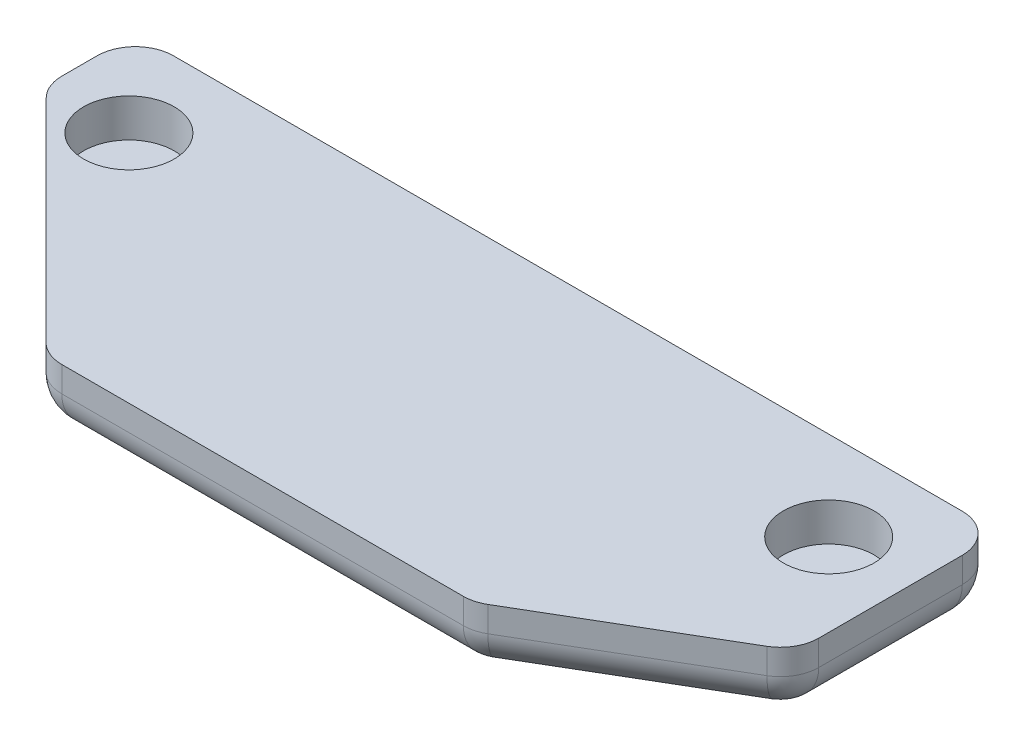
ISO-10303-21;
HEADER;
FILE_DESCRIPTION(('STEP AP214'),'2;1');
FILE_NAME('part.step','',(''),(''),'','','');
FILE_SCHEMA(('AUTOMOTIVE_DESIGN { 1 0 10303 214 1 1 1 1 }'));
ENDSEC;
DATA;
#1=APPLICATION_CONTEXT('core data for automotive mechanical design processes');
#2=APPLICATION_PROTOCOL_DEFINITION('international standard','automotive_design',2000,#1);
#3=PRODUCT_CONTEXT('',#1,'mechanical');
#4=PRODUCT('Part','Part','',(#3));
#5=PRODUCT_RELATED_PRODUCT_CATEGORY('part','',(#4));
#6=PRODUCT_DEFINITION_FORMATION('','',#4);
#7=PRODUCT_DEFINITION_CONTEXT('part definition',#1,'design');
#8=PRODUCT_DEFINITION('design','',#6,#7);
#9=PRODUCT_DEFINITION_SHAPE('','',#8);
#10=(LENGTH_UNIT() NAMED_UNIT(*) SI_UNIT(.MILLI.,.METRE.));
#11=(NAMED_UNIT(*) PLANE_ANGLE_UNIT() SI_UNIT($,.RADIAN.));
#12=(NAMED_UNIT(*) SI_UNIT($,.STERADIAN.) SOLID_ANGLE_UNIT());
#13=UNCERTAINTY_MEASURE_WITH_UNIT(LENGTH_MEASURE(1.E-05),#10,'distance_accuracy_value','');
#14=(GEOMETRIC_REPRESENTATION_CONTEXT(3) GLOBAL_UNCERTAINTY_ASSIGNED_CONTEXT((#13)) GLOBAL_UNIT_ASSIGNED_CONTEXT((#10,
#11,#12)) REPRESENTATION_CONTEXT('',''));
#15=CARTESIAN_POINT('',(0.,0.,0.));
#16=DIRECTION('',(0.,0.,1.));
#17=DIRECTION('',(1.,0.,0.));
#18=AXIS2_PLACEMENT_3D('',#15,#16,#17);
#19=CARTESIAN_POINT('',(-21.2161538362544,2.5,-11.7419034293701));
#20=DIRECTION('',(0.,0.,1.));
#21=DIRECTION('',(1.,0.,0.));
#22=AXIS2_PLACEMENT_3D('',#19,#20,#21);
#23=PLANE('',#22);
#24=DIRECTION('',(-1.,0.,0.));
#25=VECTOR('',#24,1.);
#26=CARTESIAN_POINT('',(-21.2161538362544,2.5,-11.7419034293701));
#27=LINE('',#26,#25);
#28=CARTESIAN_POINT('',(11.2838461637456,2.5,-11.7419034293701));
#29=VERTEX_POINT('',#28);
#30=CARTESIAN_POINT('',(-19.7161538362544,2.5,-11.7419034293701));
#31=VERTEX_POINT('',#30);
#32=EDGE_CURVE('E341',#29,#31,#27,.T.);
#33=ORIENTED_EDGE('',*,*,#32,.F.);
#34=DIRECTION('',(0.,-1.,0.));
#35=VECTOR('',#34,1.);
#36=CARTESIAN_POINT('',(11.2838461637456,2.5,-11.7419034293701));
#37=LINE('',#36,#35);
#38=CARTESIAN_POINT('',(11.2838461637456,1.5,-11.7419034293701));
#39=VERTEX_POINT('',#38);
#40=EDGE_CURVE('E11',#29,#39,#37,.T.);
#41=ORIENTED_EDGE('',*,*,#40,.T.);
#42=DIRECTION('',(-1.,0.,0.));
#43=VECTOR('',#42,1.);
#44=CARTESIAN_POINT('',(-21.2161538362544,1.5,-11.7419034293701));
#45=LINE('',#44,#43);
#46=CARTESIAN_POINT('',(-19.7161538362544,1.5,-11.7419034293701));
#47=VERTEX_POINT('',#46);
#48=EDGE_CURVE('E54',#39,#47,#45,.T.);
#49=ORIENTED_EDGE('',*,*,#48,.T.);
#50=DIRECTION('',(0.,-1.,0.));
#51=VECTOR('',#50,1.);
#52=CARTESIAN_POINT('',(-19.7161538362544,2.5,-11.7419034293701));
#53=LINE('',#52,#51);
#54=EDGE_CURVE('E253',#47,#31,#53,.F.);
#55=ORIENTED_EDGE('',*,*,#54,.T.);
#56=EDGE_LOOP('',(#33,#41,#49,#55));
#57=FACE_BOUND('',#56,.T.);
#58=ADVANCED_FACE('F44',(#57),#23,.F.);
#59=CARTESIAN_POINT('',(-21.2161538362544,2.5,-11.7419034293701));
#60=DIRECTION('',(1.,0.,0.));
#61=DIRECTION('',(0.,0.,-1.));
#62=AXIS2_PLACEMENT_3D('',#59,#60,#61);
#63=PLANE('',#62);
#64=DIRECTION('',(0.,0.,1.));
#65=VECTOR('',#64,1.);
#66=CARTESIAN_POINT('',(-21.2161538362544,1.5,-11.7419034293701));
#67=LINE('',#66,#65);
#68=CARTESIAN_POINT('',(-21.2161538362544,1.5,-10.2419034293701));
#69=VERTEX_POINT('',#68);
#70=CARTESIAN_POINT('',(-21.2161538362544,1.5,-8.86280756999537));
#71=VERTEX_POINT('',#70);
#72=EDGE_CURVE('E219',#69,#71,#67,.T.);
#73=ORIENTED_EDGE('',*,*,#72,.T.);
#74=DIRECTION('',(0.,-1.,0.));
#75=VECTOR('',#74,1.);
#76=CARTESIAN_POINT('',(-21.2161538362544,2.5,-8.86280756999537));
#77=LINE('',#76,#75);
#78=CARTESIAN_POINT('',(-21.2161538362544,2.5,-8.86280756999537));
#79=VERTEX_POINT('',#78);
#80=EDGE_CURVE('E222',#71,#79,#77,.F.);
#81=ORIENTED_EDGE('',*,*,#80,.T.);
#82=DIRECTION('',(0.,0.,1.));
#83=VECTOR('',#82,1.);
#84=CARTESIAN_POINT('',(-21.2161538362544,2.5,-11.7419034293701));
#85=LINE('',#84,#83);
#86=CARTESIAN_POINT('',(-21.2161538362544,2.5,-10.2419034293701));
#87=VERTEX_POINT('',#86);
#88=EDGE_CURVE('E345',#87,#79,#85,.T.);
#89=ORIENTED_EDGE('',*,*,#88,.F.);
#90=DIRECTION('',(0.,-1.,0.));
#91=VECTOR('',#90,1.);
#92=CARTESIAN_POINT('',(-21.2161538362544,2.5,-10.2419034293701));
#93=LINE('',#92,#91);
#94=EDGE_CURVE('E216',#87,#69,#93,.T.);
#95=ORIENTED_EDGE('',*,*,#94,.T.);
#96=EDGE_LOOP('',(#73,#81,#89,#95));
#97=FACE_BOUND('',#96,.T.);
#98=ADVANCED_FACE('F389',(#97),#63,.F.);
#99=CARTESIAN_POINT('',(-21.2161538362544,2.5,-8.24190342937014));
#100=DIRECTION('',(0.707441668944865,0.,-0.706771734749278));
#101=DIRECTION('',(-0.706771734749278,0.,-0.707441668944865));
#102=AXIS2_PLACEMENT_3D('',#99,#100,#101);
#103=PLANE('',#102);
#104=DIRECTION('',(0.706771734749278,0.,0.707441668944865));
#105=VECTOR('',#104,1.);
#106=CARTESIAN_POINT('',(-21.2161538362544,1.5,-8.24190342937014));
#107=LINE('',#106,#105);
#108=CARTESIAN_POINT('',(-20.7773163396717,1.5,-7.80264996787145));
#109=VERTEX_POINT('',#108);
#110=CARTESIAN_POINT('',(-12.4642919415987,1.5,0.518254172753774));
#111=VERTEX_POINT('',#110);
#112=EDGE_CURVE('E210',#109,#111,#107,.T.);
#113=ORIENTED_EDGE('',*,*,#112,.T.);
#114=DIRECTION('',(0.,-1.,0.));
#115=VECTOR('',#114,1.);
#116=CARTESIAN_POINT('',(-12.4642919415987,2.5,0.518254172753774));
#117=LINE('',#116,#115);
#118=CARTESIAN_POINT('',(-12.4642919415987,2.5,0.518254172753774));
#119=VERTEX_POINT('',#118);
#120=EDGE_CURVE('E213',#111,#119,#117,.F.);
#121=ORIENTED_EDGE('',*,*,#120,.T.);
#122=DIRECTION('',(0.706771734749278,0.,0.707441668944865));
#123=VECTOR('',#122,1.);
#124=CARTESIAN_POINT('',(-21.2161538362544,2.5,-8.24190342937014));
#125=LINE('',#124,#123);
#126=CARTESIAN_POINT('',(-20.7773163396717,2.5,-7.80264996787145));
#127=VERTEX_POINT('',#126);
#128=EDGE_CURVE('E350',#127,#119,#125,.T.);
#129=ORIENTED_EDGE('',*,*,#128,.F.);
#130=DIRECTION('',(0.,-1.,0.));
#131=VECTOR('',#130,1.);
#132=CARTESIAN_POINT('',(-20.7773163396717,2.5,-7.80264996787145));
#133=LINE('',#132,#131);
#134=EDGE_CURVE('E162',#127,#109,#133,.T.);
#135=ORIENTED_EDGE('',*,*,#134,.T.);
#136=EDGE_LOOP('',(#113,#121,#129,#135));
#137=FACE_BOUND('',#136,.T.);
#138=ADVANCED_FACE('F394',(#137),#103,.F.);
#139=CARTESIAN_POINT('',(-12.0248660663505,2.5,0.958096570629856));
#140=DIRECTION('',(0.,0.,-1.));
#141=DIRECTION('',(-1.,0.,0.));
#142=AXIS2_PLACEMENT_3D('',#139,#140,#141);
#143=PLANE('',#142);
#144=DIRECTION('',(1.,0.,0.));
#145=VECTOR('',#144,1.);
#146=CARTESIAN_POINT('',(-12.0248660663505,1.5,0.958096570629856));
#147=LINE('',#146,#145);
#148=CARTESIAN_POINT('',(-11.4031294381814,1.5,0.958096570629856));
#149=VERTEX_POINT('',#148);
#150=CARTESIAN_POINT('',(4.37582391861445,1.5,0.958096570629853));
#151=VERTEX_POINT('',#150);
#152=EDGE_CURVE('E179',#149,#151,#147,.T.);
#153=ORIENTED_EDGE('',*,*,#152,.T.);
#154=DIRECTION('',(0.,-1.,0.));
#155=VECTOR('',#154,1.);
#156=CARTESIAN_POINT('',(4.37582391861445,2.5,0.958096570629853));
#157=LINE('',#156,#155);
#158=CARTESIAN_POINT('',(4.37582391861445,2.5,0.958096570629853));
#159=VERTEX_POINT('',#158);
#160=EDGE_CURVE('E191',#151,#159,#157,.F.);
#161=ORIENTED_EDGE('',*,*,#160,.T.);
#162=DIRECTION('',(1.,0.,0.));
#163=VECTOR('',#162,1.);
#164=CARTESIAN_POINT('',(-12.0248660663505,2.5,0.958096570629856));
#165=LINE('',#164,#163);
#166=CARTESIAN_POINT('',(-11.4031294381814,2.5,0.958096570629856));
#167=VERTEX_POINT('',#166);
#168=EDGE_CURVE('E157',#167,#159,#165,.T.);
#169=ORIENTED_EDGE('',*,*,#168,.F.);
#170=DIRECTION('',(0.,-1.,0.));
#171=VECTOR('',#170,1.);
#172=CARTESIAN_POINT('',(-11.4031294381814,2.5,0.958096570629856));
#173=LINE('',#172,#171);
#174=EDGE_CURVE('E184',#167,#149,#173,.T.);
#175=ORIENTED_EDGE('',*,*,#174,.T.);
#176=EDGE_LOOP('',(#153,#161,#169,#175));
#177=FACE_BOUND('',#176,.T.);
#178=ADVANCED_FACE('F490',(#177),#143,.F.);
#179=CARTESIAN_POINT('',(4.78384616374559,2.5,0.958096570629853));
#180=DIRECTION('',(-0.506549048630865,0.,-0.862211146605729));
#181=DIRECTION('',(-0.862211146605729,0.,0.506549048630865));
#182=AXIS2_PLACEMENT_3D('',#179,#180,#181);
#183=PLANE('',#182);
#184=DIRECTION('',(0.862211146605729,0.,-0.506549048630865));
#185=VECTOR('',#184,1.);
#186=CARTESIAN_POINT('',(4.78384616374559,2.5,0.958096570629853));
#187=LINE('',#186,#185);
#188=CARTESIAN_POINT('',(5.13564749156075,2.5,0.751413290538446));
#189=VERTEX_POINT('',#188);
#190=CARTESIAN_POINT('',(12.0436697366919,2.5,-3.3070497784761));
#191=VERTEX_POINT('',#190);
#192=EDGE_CURVE('E154',#189,#191,#187,.T.);
#193=ORIENTED_EDGE('',*,*,#192,.F.);
#194=DIRECTION('',(0.,-1.,0.));
#195=VECTOR('',#194,1.);
#196=CARTESIAN_POINT('',(5.13564749156075,2.5,0.751413290538446));
#197=LINE('',#196,#195);
#198=CARTESIAN_POINT('',(5.13564749156075,1.5,0.751413290538446));
#199=VERTEX_POINT('',#198);
#200=EDGE_CURVE('E168',#189,#199,#197,.T.);
#201=ORIENTED_EDGE('',*,*,#200,.T.);
#202=DIRECTION('',(0.862211146605729,0.,-0.506549048630865));
#203=VECTOR('',#202,1.);
#204=CARTESIAN_POINT('',(4.78384616374559,1.5,0.958096570629853));
#205=LINE('',#204,#203);
#206=CARTESIAN_POINT('',(12.0436697366919,1.5,-3.3070497784761));
#207=VERTEX_POINT('',#206);
#208=EDGE_CURVE('E180',#199,#207,#205,.T.);
#209=ORIENTED_EDGE('',*,*,#208,.T.);
#210=DIRECTION('',(0.,-1.,0.));
#211=VECTOR('',#210,1.);
#212=CARTESIAN_POINT('',(12.0436697366919,2.5,-3.3070497784761));
#213=LINE('',#212,#211);
#214=EDGE_CURVE('E170',#207,#191,#213,.F.);
#215=ORIENTED_EDGE('',*,*,#214,.T.);
#216=EDGE_LOOP('',(#193,#201,#209,#215));
#217=FACE_BOUND('',#216,.T.);
#218=ADVANCED_FACE('F167',(#217),#183,.F.);
#219=CARTESIAN_POINT('',(12.7838461637456,2.5,-3.74190342937014));
#220=DIRECTION('',(-1.,0.,0.));
#221=DIRECTION('',(0.,0.,1.));
#222=AXIS2_PLACEMENT_3D('',#219,#220,#221);
#223=PLANE('',#222);
#224=DIRECTION('',(0.,0.,-1.));
#225=VECTOR('',#224,1.);
#226=CARTESIAN_POINT('',(12.7838461637456,2.5,-3.74190342937014));
#227=LINE('',#226,#225);
#228=CARTESIAN_POINT('',(12.7838461637456,2.5,-4.60036649838469));
#229=VERTEX_POINT('',#228);
#230=CARTESIAN_POINT('',(12.7838461637456,2.5,-10.2419034293701));
#231=VERTEX_POINT('',#230);
#232=EDGE_CURVE('E172',#229,#231,#227,.T.);
#233=ORIENTED_EDGE('',*,*,#232,.F.);
#234=DIRECTION('',(0.,-1.,0.));
#235=VECTOR('',#234,1.);
#236=CARTESIAN_POINT('',(12.7838461637456,2.5,-4.60036649838469));
#237=LINE('',#236,#235);
#238=CARTESIAN_POINT('',(12.7838461637456,1.5,-4.60036649838469));
#239=VERTEX_POINT('',#238);
#240=EDGE_CURVE('E250',#229,#239,#237,.T.);
#241=ORIENTED_EDGE('',*,*,#240,.T.);
#242=DIRECTION('',(0.,0.,-1.));
#243=VECTOR('',#242,1.);
#244=CARTESIAN_POINT('',(12.7838461637456,1.5,-3.74190342937014));
#245=LINE('',#244,#243);
#246=CARTESIAN_POINT('',(12.7838461637456,1.5,-10.2419034293701));
#247=VERTEX_POINT('',#246);
#248=EDGE_CURVE('E247',#239,#247,#245,.T.);
#249=ORIENTED_EDGE('',*,*,#248,.T.);
#250=DIRECTION('',(0.,-1.,0.));
#251=VECTOR('',#250,1.);
#252=CARTESIAN_POINT('',(12.7838461637456,2.5,-10.2419034293701));
#253=LINE('',#252,#251);
#254=EDGE_CURVE('E244',#247,#231,#253,.F.);
#255=ORIENTED_EDGE('',*,*,#254,.T.);
#256=EDGE_LOOP('',(#233,#241,#249,#255));
#257=FACE_BOUND('',#256,.T.);
#258=ADVANCED_FACE('F371',(#257),#223,.F.);
#259=CARTESIAN_POINT('',(0.,2.5,0.));
#260=DIRECTION('',(0.,1.,0.));
#261=DIRECTION('',(0.,0.,1.));
#262=AXIS2_PLACEMENT_3D('',#259,#260,#261);
#263=PLANE('',#262);
#264=CARTESIAN_POINT('',(-17.9661538362544,2.5,-8.24190342937014));
#265=DIRECTION('',(0.,1.,0.));
#266=DIRECTION('',(0.,0.,1.));
#267=AXIS2_PLACEMENT_3D('',#264,#265,#266);
#268=CIRCLE('',#267,1.78);
#269=CARTESIAN_POINT('',(-17.9661538362544,2.5,-6.46190342937014));
#270=VERTEX_POINT('',#269);
#271=EDGE_CURVE('E337',#270,#270,#268,.T.);
#272=ORIENTED_EDGE('',*,*,#271,.F.);
#273=EDGE_LOOP('',(#272));
#274=FACE_BOUND('',#273,.T.);
#275=CARTESIAN_POINT('',(9.53384616374559,2.5,-8.24190342937015));
#276=DIRECTION('',(0.,1.,0.));
#277=DIRECTION('',(0.,0.,-1.));
#278=AXIS2_PLACEMENT_3D('',#275,#276,#277);
#279=CIRCLE('',#278,1.78);
#280=CARTESIAN_POINT('',(9.53384616374559,2.5,-10.0219034293702));
#281=VERTEX_POINT('',#280);
#282=EDGE_CURVE('E331',#281,#281,#279,.T.);
#283=ORIENTED_EDGE('',*,*,#282,.F.);
#284=EDGE_LOOP('',(#283));
#285=FACE_BOUND('',#284,.T.);
#286=ORIENTED_EDGE('',*,*,#168,.T.);
#287=CARTESIAN_POINT('',(4.37582391861445,2.5,-0.541903429370147));
#288=DIRECTION('',(0.,1.,0.));
#289=DIRECTION('',(0.,0.,1.));
#290=AXIS2_PLACEMENT_3D('',#287,#288,#289);
#291=CIRCLE('',#290,1.5);
#292=EDGE_CURVE('E151',#159,#189,#291,.T.);
#293=ORIENTED_EDGE('',*,*,#292,.T.);
#294=ORIENTED_EDGE('',*,*,#192,.T.);
#295=CARTESIAN_POINT('',(11.2838461637456,2.5,-4.60036649838469));
#296=DIRECTION('',(0.,1.,0.));
#297=DIRECTION('',(0.,0.,1.));
#298=AXIS2_PLACEMENT_3D('',#295,#296,#297);
#299=CIRCLE('',#298,1.5);
#300=EDGE_CURVE('E203',#191,#229,#299,.T.);
#301=ORIENTED_EDGE('',*,*,#300,.T.);
#302=ORIENTED_EDGE('',*,*,#232,.T.);
#303=CARTESIAN_POINT('',(11.2838461637456,2.5,-10.2419034293701));
#304=DIRECTION('',(0.,1.,0.));
#305=DIRECTION('',(0.,0.,1.));
#306=AXIS2_PLACEMENT_3D('',#303,#304,#305);
#307=CIRCLE('',#306,1.5);
#308=EDGE_CURVE('E200',#231,#29,#307,.T.);
#309=ORIENTED_EDGE('',*,*,#308,.T.);
#310=ORIENTED_EDGE('',*,*,#32,.T.);
#311=CARTESIAN_POINT('',(-19.7161538362544,2.5,-10.2419034293701));
#312=DIRECTION('',(0.,1.,0.));
#313=DIRECTION('',(0.,0.,1.));
#314=AXIS2_PLACEMENT_3D('',#311,#312,#313);
#315=CIRCLE('',#314,1.5);
#316=EDGE_CURVE('E194',#31,#87,#315,.T.);
#317=ORIENTED_EDGE('',*,*,#316,.T.);
#318=ORIENTED_EDGE('',*,*,#88,.T.);
#319=CARTESIAN_POINT('',(-19.7161538362544,2.5,-8.86280756999537));
#320=DIRECTION('',(0.,1.,0.));
#321=DIRECTION('',(0.,0.,1.));
#322=AXIS2_PLACEMENT_3D('',#319,#320,#321);
#323=CIRCLE('',#322,1.5);
#324=EDGE_CURVE('E197',#79,#127,#323,.T.);
#325=ORIENTED_EDGE('',*,*,#324,.T.);
#326=ORIENTED_EDGE('',*,*,#128,.T.);
#327=CARTESIAN_POINT('',(-11.4031294381814,2.5,-0.541903429370144));
#328=DIRECTION('',(0.,1.,0.));
#329=DIRECTION('',(0.,0.,1.));
#330=AXIS2_PLACEMENT_3D('',#327,#328,#329);
#331=CIRCLE('',#330,1.5);
#332=EDGE_CURVE('E163',#119,#167,#331,.T.);
#333=ORIENTED_EDGE('',*,*,#332,.T.);
#334=EDGE_LOOP('',(#286,#293,#294,#301,#302,#309,#310,#317,#318,#325,#326,#333));
#335=FACE_BOUND('',#334,.T.);
#336=ADVANCED_FACE('F153',(#274,#285,#335),#263,.T.);
#337=CARTESIAN_POINT('',(0.,0.,0.));
#338=DIRECTION('',(0.,1.,0.));
#339=DIRECTION('',(0.,0.,1.));
#340=AXIS2_PLACEMENT_3D('',#337,#338,#339);
#341=PLANE('',#340);
#342=DIRECTION('',(0.706771734749278,0.,0.707441668944865));
#343=VECTOR('',#342,1.);
#344=CARTESIAN_POINT('',(-5.4360149590119,0.,5.43086715323706));
#345=LINE('',#344,#343);
#346=CARTESIAN_POINT('',(-11.4031294381814,0.,-0.541903429370144));
#347=VERTEX_POINT('',#346);
#348=CARTESIAN_POINT('',(-19.7161538362544,0.,-8.86280756999537));
#349=VERTEX_POINT('',#348);
#350=EDGE_CURVE('E237',#347,#349,#345,.F.);
#351=ORIENTED_EDGE('',*,*,#350,.T.);
#352=DIRECTION('',(0.,0.,1.));
#353=VECTOR('',#352,1.);
#354=CARTESIAN_POINT('',(-19.7161538362544,0.,0.));
#355=LINE('',#354,#353);
#356=CARTESIAN_POINT('',(-19.7161538362544,0.,-10.2419034293701));
#357=VERTEX_POINT('',#356);
#358=EDGE_CURVE('E240',#349,#357,#355,.F.);
#359=ORIENTED_EDGE('',*,*,#358,.T.);
#360=DIRECTION('',(-1.,0.,0.));
#361=VECTOR('',#360,1.);
#362=CARTESIAN_POINT('',(0.,0.,-10.2419034293701));
#363=LINE('',#362,#361);
#364=CARTESIAN_POINT('',(11.2838461637456,0.,-10.2419034293701));
#365=VERTEX_POINT('',#364);
#366=EDGE_CURVE('E225',#357,#365,#363,.F.);
#367=ORIENTED_EDGE('',*,*,#366,.T.);
#368=DIRECTION('',(0.,0.,-1.));
#369=VECTOR('',#368,1.);
#370=CARTESIAN_POINT('',(11.2838461637456,0.,0.));
#371=LINE('',#370,#369);
#372=CARTESIAN_POINT('',(11.2838461637456,0.,-4.60036649838469));
#373=VERTEX_POINT('',#372);
#374=EDGE_CURVE('E228',#365,#373,#371,.F.);
#375=ORIENTED_EDGE('',*,*,#374,.T.);
#376=DIRECTION('',(0.862211146605729,0.,-0.506549048630865));
#377=VECTOR('',#376,1.);
#378=CARTESIAN_POINT('',(0.886123608059888,0.,1.50829550308066));
#379=LINE('',#378,#377);
#380=CARTESIAN_POINT('',(4.37582391861445,0.,-0.541903429370147));
#381=VERTEX_POINT('',#380);
#382=EDGE_CURVE('E231',#373,#381,#379,.F.);
#383=ORIENTED_EDGE('',*,*,#382,.T.);
#384=DIRECTION('',(1.,0.,0.));
#385=VECTOR('',#384,1.);
#386=CARTESIAN_POINT('',(0.,0.,-0.541903429370146));
#387=LINE('',#386,#385);
#388=EDGE_CURVE('E234',#381,#347,#387,.F.);
#389=ORIENTED_EDGE('',*,*,#388,.T.);
#390=EDGE_LOOP('',(#351,#359,#367,#375,#383,#389));
#391=FACE_BOUND('',#390,.T.);
#392=ADVANCED_FACE('F370',(#391),#341,.F.);
#393=CARTESIAN_POINT('',(9.53384616374559,1.,-8.24190342937015));
#394=DIRECTION('',(0.,1.,0.));
#395=DIRECTION('',(0.,0.,1.));
#396=AXIS2_PLACEMENT_3D('',#393,#394,#395);
#397=CYLINDRICAL_SURFACE('',#396,1.78);
#398=CARTESIAN_POINT('',(9.53384616374559,1.,-8.24190342937015));
#399=DIRECTION('',(0.,1.,0.));
#400=DIRECTION('',(0.,0.,-1.));
#401=AXIS2_PLACEMENT_3D('',#398,#399,#400);
#402=CIRCLE('',#401,1.78);
#403=CARTESIAN_POINT('',(9.53384616374559,1.,-10.0219034293702));
#404=VERTEX_POINT('',#403);
#405=EDGE_CURVE('E325',#404,#404,#402,.T.);
#406=ORIENTED_EDGE('',*,*,#405,.F.);
#407=EDGE_LOOP('',(#406));
#408=FACE_BOUND('',#407,.T.);
#409=ORIENTED_EDGE('',*,*,#282,.T.);
#410=EDGE_LOOP('',(#409));
#411=FACE_BOUND('',#410,.T.);
#412=ADVANCED_FACE('F375',(#408,#411),#397,.F.);
#413=CARTESIAN_POINT('',(9.53384616374559,1.,-8.24190342937015));
#414=DIRECTION('',(0.,-1.,0.));
#415=DIRECTION('',(0.,0.,-1.));
#416=AXIS2_PLACEMENT_3D('',#413,#414,#415);
#417=PLANE('',#416);
#418=ORIENTED_EDGE('',*,*,#405,.T.);
#419=EDGE_LOOP('',(#418));
#420=FACE_BOUND('',#419,.T.);
#421=ADVANCED_FACE('F377',(#420),#417,.F.);
#422=CARTESIAN_POINT('',(-17.9661538362544,1.,-8.24190342937014));
#423=DIRECTION('',(0.,1.,0.));
#424=DIRECTION('',(0.,0.,1.));
#425=AXIS2_PLACEMENT_3D('',#422,#423,#424);
#426=CYLINDRICAL_SURFACE('',#425,1.78);
#427=CARTESIAN_POINT('',(-17.9661538362544,1.,-8.24190342937014));
#428=DIRECTION('',(0.,1.,0.));
#429=DIRECTION('',(0.,0.,1.));
#430=AXIS2_PLACEMENT_3D('',#427,#428,#429);
#431=CIRCLE('',#430,1.78);
#432=CARTESIAN_POINT('',(-17.9661538362544,1.,-6.46190342937014));
#433=VERTEX_POINT('',#432);
#434=EDGE_CURVE('E346',#433,#433,#431,.T.);
#435=ORIENTED_EDGE('',*,*,#434,.F.);
#436=EDGE_LOOP('',(#435));
#437=FACE_BOUND('',#436,.T.);
#438=ORIENTED_EDGE('',*,*,#271,.T.);
#439=EDGE_LOOP('',(#438));
#440=FACE_BOUND('',#439,.T.);
#441=ADVANCED_FACE('F366',(#437,#440),#426,.F.);
#442=CARTESIAN_POINT('',(-17.9661538362544,1.,-8.24190342937014));
#443=DIRECTION('',(0.,1.,0.));
#444=DIRECTION('',(0.,0.,1.));
#445=AXIS2_PLACEMENT_3D('',#442,#443,#444);
#446=PLANE('',#445);
#447=ORIENTED_EDGE('',*,*,#434,.T.);
#448=EDGE_LOOP('',(#447));
#449=FACE_BOUND('',#448,.T.);
#450=ADVANCED_FACE('F464',(#449),#446,.T.);
#451=CARTESIAN_POINT('',(-19.7161538362544,2.5,-10.2419034293701));
#452=DIRECTION('',(0.,-1.,0.));
#453=DIRECTION('',(0.,0.,-1.));
#454=AXIS2_PLACEMENT_3D('',#451,#452,#453);
#455=CYLINDRICAL_SURFACE('',#454,1.5);
#456=CARTESIAN_POINT('',(-19.7161538362544,1.5,-10.2419034293701));
#457=DIRECTION('',(0.,-1.,0.));
#458=DIRECTION('',(0.,0.,-1.));
#459=AXIS2_PLACEMENT_3D('',#456,#457,#458);
#460=CIRCLE('',#459,1.5);
#461=EDGE_CURVE('E48',#69,#47,#460,.T.);
#462=ORIENTED_EDGE('',*,*,#461,.F.);
#463=ORIENTED_EDGE('',*,*,#94,.F.);
#464=ORIENTED_EDGE('',*,*,#316,.F.);
#465=ORIENTED_EDGE('',*,*,#54,.F.);
#466=EDGE_LOOP('',(#462,#463,#464,#465));
#467=FACE_BOUND('',#466,.T.);
#468=ADVANCED_FACE('F46',(#467),#455,.T.);
#469=CARTESIAN_POINT('',(-19.7161538362544,1.5,-10.2419034293701));
#470=DIRECTION('',(0.,0.,-1.));
#471=DIRECTION('',(-1.,0.,0.));
#472=AXIS2_PLACEMENT_3D('',#469,#470,#471);
#473=SPHERICAL_SURFACE('',#472,1.5);
#474=CARTESIAN_POINT('',(-19.7161538362544,1.5,-10.2419034293701));
#475=DIRECTION('',(0.,0.,-1.));
#476=DIRECTION('',(-1.,0.,0.));
#477=AXIS2_PLACEMENT_3D('',#474,#475,#476);
#478=CIRCLE('',#477,1.5);
#479=EDGE_CURVE('E315',#69,#357,#478,.F.);
#480=ORIENTED_EDGE('',*,*,#479,.F.);
#481=ORIENTED_EDGE('',*,*,#461,.T.);
#482=CARTESIAN_POINT('',(-19.7161538362544,1.5,-10.2419034293701));
#483=DIRECTION('',(-1.,0.,0.));
#484=DIRECTION('',(0.,0.,1.));
#485=AXIS2_PLACEMENT_3D('',#482,#483,#484);
#486=CIRCLE('',#485,1.5);
#487=EDGE_CURVE('E318',#357,#47,#486,.F.);
#488=ORIENTED_EDGE('',*,*,#487,.F.);
#489=EDGE_LOOP('',(#480,#481,#488));
#490=FACE_BOUND('',#489,.T.);
#491=ADVANCED_FACE('F458',(#490),#473,.T.);
#492=CARTESIAN_POINT('',(11.2838461637456,2.5,-10.2419034293701));
#493=DIRECTION('',(0.,-1.,0.));
#494=DIRECTION('',(0.,0.,-1.));
#495=AXIS2_PLACEMENT_3D('',#492,#493,#494);
#496=CYLINDRICAL_SURFACE('',#495,1.5);
#497=ORIENTED_EDGE('',*,*,#308,.F.);
#498=ORIENTED_EDGE('',*,*,#254,.F.);
#499=CARTESIAN_POINT('',(11.2838461637456,1.5,-10.2419034293701));
#500=DIRECTION('',(0.,-1.,0.));
#501=DIRECTION('',(0.,0.,-1.));
#502=AXIS2_PLACEMENT_3D('',#499,#500,#501);
#503=CIRCLE('',#502,1.5);
#504=EDGE_CURVE('E311',#39,#247,#503,.T.);
#505=ORIENTED_EDGE('',*,*,#504,.F.);
#506=ORIENTED_EDGE('',*,*,#40,.F.);
#507=EDGE_LOOP('',(#497,#498,#505,#506));
#508=FACE_BOUND('',#507,.T.);
#509=ADVANCED_FACE('F456',(#508),#496,.T.);
#510=CARTESIAN_POINT('',(-21.2161538362544,1.5,-10.2419034293701));
#511=DIRECTION('',(-1.,0.,0.));
#512=DIRECTION('',(0.,0.,1.));
#513=AXIS2_PLACEMENT_3D('',#510,#511,#512);
#514=CYLINDRICAL_SURFACE('',#513,1.5);
#515=ORIENTED_EDGE('',*,*,#487,.T.);
#516=ORIENTED_EDGE('',*,*,#48,.F.);
#517=CARTESIAN_POINT('',(11.2838461637456,1.5,-10.2419034293701));
#518=DIRECTION('',(1.,0.,0.));
#519=DIRECTION('',(0.,0.,-1.));
#520=AXIS2_PLACEMENT_3D('',#517,#518,#519);
#521=CIRCLE('',#520,1.5);
#522=EDGE_CURVE('E307',#365,#39,#521,.T.);
#523=ORIENTED_EDGE('',*,*,#522,.F.);
#524=ORIENTED_EDGE('',*,*,#366,.F.);
#525=EDGE_LOOP('',(#515,#516,#523,#524));
#526=FACE_BOUND('',#525,.T.);
#527=ADVANCED_FACE('F452',(#526),#514,.T.);
#528=CARTESIAN_POINT('',(-19.7161538362544,1.5,-11.7419034293701));
#529=DIRECTION('',(0.,0.,1.));
#530=DIRECTION('',(1.,0.,0.));
#531=AXIS2_PLACEMENT_3D('',#528,#529,#530);
#532=CYLINDRICAL_SURFACE('',#531,1.5);
#533=ORIENTED_EDGE('',*,*,#479,.T.);
#534=ORIENTED_EDGE('',*,*,#358,.F.);
#535=CARTESIAN_POINT('',(-19.7161538362544,1.5,-8.86280756999537));
#536=DIRECTION('',(0.,0.,1.));
#537=DIRECTION('',(1.,0.,0.));
#538=AXIS2_PLACEMENT_3D('',#535,#536,#537);
#539=CIRCLE('',#538,1.5);
#540=EDGE_CURVE('E303',#71,#349,#539,.T.);
#541=ORIENTED_EDGE('',*,*,#540,.F.);
#542=ORIENTED_EDGE('',*,*,#72,.F.);
#543=EDGE_LOOP('',(#533,#534,#541,#542));
#544=FACE_BOUND('',#543,.T.);
#545=ADVANCED_FACE('F448',(#544),#532,.T.);
#546=CARTESIAN_POINT('',(-19.7161538362544,2.5,-8.86280756999537));
#547=DIRECTION('',(0.,-1.,0.));
#548=DIRECTION('',(0.,0.,-1.));
#549=AXIS2_PLACEMENT_3D('',#546,#547,#548);
#550=CYLINDRICAL_SURFACE('',#549,1.5);
#551=ORIENTED_EDGE('',*,*,#324,.F.);
#552=ORIENTED_EDGE('',*,*,#80,.F.);
#553=CARTESIAN_POINT('',(-19.7161538362544,1.5,-8.86280756999537));
#554=DIRECTION('',(0.,-1.,0.));
#555=DIRECTION('',(0.,0.,-1.));
#556=AXIS2_PLACEMENT_3D('',#553,#554,#555);
#557=CIRCLE('',#556,1.5);
#558=EDGE_CURVE('E299',#109,#71,#557,.T.);
#559=ORIENTED_EDGE('',*,*,#558,.F.);
#560=ORIENTED_EDGE('',*,*,#134,.F.);
#561=EDGE_LOOP('',(#551,#552,#559,#560));
#562=FACE_BOUND('',#561,.T.);
#563=ADVANCED_FACE('F444',(#562),#550,.T.);
#564=CARTESIAN_POINT('',(11.2838461637456,1.5,-10.2419034293701));
#565=DIRECTION('',(0.,0.,-1.));
#566=DIRECTION('',(-1.,0.,0.));
#567=AXIS2_PLACEMENT_3D('',#564,#565,#566);
#568=SPHERICAL_SURFACE('',#567,1.5);
#569=ORIENTED_EDGE('',*,*,#522,.T.);
#570=ORIENTED_EDGE('',*,*,#504,.T.);
#571=CARTESIAN_POINT('',(11.2838461637456,1.5,-10.2419034293701));
#572=DIRECTION('',(0.,0.,-1.));
#573=DIRECTION('',(-1.,0.,0.));
#574=AXIS2_PLACEMENT_3D('',#571,#572,#573);
#575=CIRCLE('',#574,1.5);
#576=EDGE_CURVE('E295',#365,#247,#575,.F.);
#577=ORIENTED_EDGE('',*,*,#576,.F.);
#578=EDGE_LOOP('',(#569,#570,#577));
#579=FACE_BOUND('',#578,.T.);
#580=ADVANCED_FACE('F440',(#579),#568,.T.);
#581=CARTESIAN_POINT('',(-19.7161538362544,1.5,-8.86280756999537));
#582=DIRECTION('',(0.,-1.,0.));
#583=DIRECTION('',(0.,0.,-1.));
#584=AXIS2_PLACEMENT_3D('',#581,#582,#583);
#585=SPHERICAL_SURFACE('',#584,1.5);
#586=ORIENTED_EDGE('',*,*,#558,.T.);
#587=ORIENTED_EDGE('',*,*,#540,.T.);
#588=CARTESIAN_POINT('',(-19.7161538362544,1.5,-8.86280756999537));
#589=DIRECTION('',(-0.706771734749278,0.,-0.707441668944865));
#590=DIRECTION('',(-0.707441668944865,0.,0.706771734749278));
#591=AXIS2_PLACEMENT_3D('',#588,#589,#590);
#592=CIRCLE('',#591,1.5);
#593=EDGE_CURVE('E291',#109,#349,#592,.F.);
#594=ORIENTED_EDGE('',*,*,#593,.F.);
#595=EDGE_LOOP('',(#586,#587,#594));
#596=FACE_BOUND('',#595,.T.);
#597=ADVANCED_FACE('F436',(#596),#585,.T.);
#598=CARTESIAN_POINT('',(11.2838461637456,2.5,-4.60036649838469));
#599=DIRECTION('',(0.,-1.,0.));
#600=DIRECTION('',(0.,0.,-1.));
#601=AXIS2_PLACEMENT_3D('',#598,#599,#600);
#602=CYLINDRICAL_SURFACE('',#601,1.5);
#603=ORIENTED_EDGE('',*,*,#300,.F.);
#604=ORIENTED_EDGE('',*,*,#214,.F.);
#605=CARTESIAN_POINT('',(11.2838461637456,1.5,-4.60036649838469));
#606=DIRECTION('',(0.,-1.,0.));
#607=DIRECTION('',(0.,0.,-1.));
#608=AXIS2_PLACEMENT_3D('',#605,#606,#607);
#609=CIRCLE('',#608,1.5);
#610=EDGE_CURVE('E287',#239,#207,#609,.T.);
#611=ORIENTED_EDGE('',*,*,#610,.F.);
#612=ORIENTED_EDGE('',*,*,#240,.F.);
#613=EDGE_LOOP('',(#603,#604,#611,#612));
#614=FACE_BOUND('',#613,.T.);
#615=ADVANCED_FACE('F432',(#614),#602,.T.);
#616=CARTESIAN_POINT('',(11.2838461637456,1.5,-3.74190342937015));
#617=DIRECTION('',(0.,0.,-1.));
#618=DIRECTION('',(-1.,0.,0.));
#619=AXIS2_PLACEMENT_3D('',#616,#617,#618);
#620=CYLINDRICAL_SURFACE('',#619,1.5);
#621=ORIENTED_EDGE('',*,*,#576,.T.);
#622=ORIENTED_EDGE('',*,*,#248,.F.);
#623=CARTESIAN_POINT('',(11.2838461637456,1.5,-4.60036649838469));
#624=DIRECTION('',(0.,0.,1.));
#625=DIRECTION('',(1.,0.,0.));
#626=AXIS2_PLACEMENT_3D('',#623,#624,#625);
#627=CIRCLE('',#626,1.5);
#628=EDGE_CURVE('E283',#373,#239,#627,.T.);
#629=ORIENTED_EDGE('',*,*,#628,.F.);
#630=ORIENTED_EDGE('',*,*,#374,.F.);
#631=EDGE_LOOP('',(#621,#622,#629,#630));
#632=FACE_BOUND('',#631,.T.);
#633=ADVANCED_FACE('F428',(#632),#620,.T.);
#634=CARTESIAN_POINT('',(-20.1549913328371,1.5,-9.30206103149406));
#635=DIRECTION('',(0.706771734749278,0.,0.707441668944865));
#636=DIRECTION('',(0.707441668944865,0.,-0.706771734749278));
#637=AXIS2_PLACEMENT_3D('',#634,#635,#636);
#638=CYLINDRICAL_SURFACE('',#637,1.5);
#639=ORIENTED_EDGE('',*,*,#593,.T.);
#640=ORIENTED_EDGE('',*,*,#350,.F.);
#641=CARTESIAN_POINT('',(-11.4031294381814,1.5,-0.541903429370143));
#642=DIRECTION('',(0.706771734749279,0.,0.707441668944865));
#643=DIRECTION('',(0.707441668944865,0.,-0.706771734749279));
#644=AXIS2_PLACEMENT_3D('',#641,#642,#643);
#645=CIRCLE('',#644,1.5);
#646=EDGE_CURVE('E279',#111,#347,#645,.T.);
#647=ORIENTED_EDGE('',*,*,#646,.F.);
#648=ORIENTED_EDGE('',*,*,#112,.F.);
#649=EDGE_LOOP('',(#639,#640,#647,#648));
#650=FACE_BOUND('',#649,.T.);
#651=ADVANCED_FACE('F424',(#650),#638,.T.);
#652=CARTESIAN_POINT('',(-11.4031294381814,2.5,-0.541903429370144));
#653=DIRECTION('',(0.,-1.,0.));
#654=DIRECTION('',(0.,0.,-1.));
#655=AXIS2_PLACEMENT_3D('',#652,#653,#654);
#656=CYLINDRICAL_SURFACE('',#655,1.5);
#657=ORIENTED_EDGE('',*,*,#332,.F.);
#658=ORIENTED_EDGE('',*,*,#120,.F.);
#659=CARTESIAN_POINT('',(-11.4031294381814,1.5,-0.541903429370144));
#660=DIRECTION('',(0.,-1.,0.));
#661=DIRECTION('',(0.,0.,-1.));
#662=AXIS2_PLACEMENT_3D('',#659,#660,#661);
#663=CIRCLE('',#662,1.5);
#664=EDGE_CURVE('E275',#149,#111,#663,.T.);
#665=ORIENTED_EDGE('',*,*,#664,.F.);
#666=ORIENTED_EDGE('',*,*,#174,.F.);
#667=EDGE_LOOP('',(#657,#658,#665,#666));
#668=FACE_BOUND('',#667,.T.);
#669=ADVANCED_FACE('F420',(#668),#656,.T.);
#670=CARTESIAN_POINT('',(11.2838461637456,1.5,-4.60036649838469));
#671=DIRECTION('',(0.,-1.,0.));
#672=DIRECTION('',(0.,0.,-1.));
#673=AXIS2_PLACEMENT_3D('',#670,#671,#672);
#674=SPHERICAL_SURFACE('',#673,1.5);
#675=ORIENTED_EDGE('',*,*,#628,.T.);
#676=ORIENTED_EDGE('',*,*,#610,.T.);
#677=CARTESIAN_POINT('',(11.2838461637456,1.5,-4.60036649838469));
#678=DIRECTION('',(0.862211146605729,0.,-0.506549048630865));
#679=DIRECTION('',(-0.506549048630865,0.,-0.862211146605729));
#680=AXIS2_PLACEMENT_3D('',#677,#678,#679);
#681=CIRCLE('',#680,1.5);
#682=EDGE_CURVE('E271',#373,#207,#681,.F.);
#683=ORIENTED_EDGE('',*,*,#682,.F.);
#684=EDGE_LOOP('',(#675,#676,#683));
#685=FACE_BOUND('',#684,.T.);
#686=ADVANCED_FACE('F416',(#685),#674,.T.);
#687=CARTESIAN_POINT('',(-11.4031294381814,1.5,-0.541903429370144));
#688=DIRECTION('',(0.,-1.,0.));
#689=DIRECTION('',(0.,0.,-1.));
#690=AXIS2_PLACEMENT_3D('',#687,#688,#689);
#691=SPHERICAL_SURFACE('',#690,1.5);
#692=ORIENTED_EDGE('',*,*,#664,.T.);
#693=ORIENTED_EDGE('',*,*,#646,.T.);
#694=CARTESIAN_POINT('',(-11.4031294381814,1.5,-0.541903429370144));
#695=DIRECTION('',(-1.,0.,0.));
#696=DIRECTION('',(0.,0.,1.));
#697=AXIS2_PLACEMENT_3D('',#694,#695,#696);
#698=CIRCLE('',#697,1.5);
#699=EDGE_CURVE('E267',#149,#347,#698,.F.);
#700=ORIENTED_EDGE('',*,*,#699,.F.);
#701=EDGE_LOOP('',(#692,#693,#700));
#702=FACE_BOUND('',#701,.T.);
#703=ADVANCED_FACE('F412',(#702),#691,.T.);
#704=CARTESIAN_POINT('',(4.02402259079929,1.5,-0.33522014927874));
#705=DIRECTION('',(0.862211146605729,0.,-0.506549048630865));
#706=DIRECTION('',(-0.506549048630865,0.,-0.862211146605729));
#707=AXIS2_PLACEMENT_3D('',#704,#705,#706);
#708=CYLINDRICAL_SURFACE('',#707,1.5);
#709=ORIENTED_EDGE('',*,*,#682,.T.);
#710=ORIENTED_EDGE('',*,*,#208,.F.);
#711=CARTESIAN_POINT('',(4.37582391861445,1.5,-0.541903429370147));
#712=DIRECTION('',(-0.862211146605729,0.,0.506549048630865));
#713=DIRECTION('',(0.506549048630865,0.,0.862211146605729));
#714=AXIS2_PLACEMENT_3D('',#711,#712,#713);
#715=CIRCLE('',#714,1.5);
#716=EDGE_CURVE('E264',#381,#199,#715,.T.);
#717=ORIENTED_EDGE('',*,*,#716,.F.);
#718=ORIENTED_EDGE('',*,*,#382,.F.);
#719=EDGE_LOOP('',(#709,#710,#717,#718));
#720=FACE_BOUND('',#719,.T.);
#721=ADVANCED_FACE('F408',(#720),#708,.T.);
#722=CARTESIAN_POINT('',(-12.0248660663505,1.5,-0.541903429370144));
#723=DIRECTION('',(1.,0.,0.));
#724=DIRECTION('',(0.,0.,-1.));
#725=AXIS2_PLACEMENT_3D('',#722,#723,#724);
#726=CYLINDRICAL_SURFACE('',#725,1.5);
#727=ORIENTED_EDGE('',*,*,#699,.T.);
#728=ORIENTED_EDGE('',*,*,#388,.F.);
#729=CARTESIAN_POINT('',(4.37582391861445,1.5,-0.541903429370147));
#730=DIRECTION('',(1.,0.,0.));
#731=DIRECTION('',(0.,0.,-1.));
#732=AXIS2_PLACEMENT_3D('',#729,#730,#731);
#733=CIRCLE('',#732,1.5);
#734=EDGE_CURVE('E260',#151,#381,#733,.T.);
#735=ORIENTED_EDGE('',*,*,#734,.F.);
#736=ORIENTED_EDGE('',*,*,#152,.F.);
#737=EDGE_LOOP('',(#727,#728,#735,#736));
#738=FACE_BOUND('',#737,.T.);
#739=ADVANCED_FACE('F404',(#738),#726,.T.);
#740=CARTESIAN_POINT('',(4.37582391861445,1.5,-0.541903429370147));
#741=DIRECTION('',(0.,-1.,0.));
#742=DIRECTION('',(0.,0.,-1.));
#743=AXIS2_PLACEMENT_3D('',#740,#741,#742);
#744=SPHERICAL_SURFACE('',#743,1.5);
#745=ORIENTED_EDGE('',*,*,#734,.T.);
#746=ORIENTED_EDGE('',*,*,#716,.T.);
#747=CARTESIAN_POINT('',(4.37582391861445,1.5,-0.541903429370147));
#748=DIRECTION('',(0.,-1.,0.));
#749=DIRECTION('',(0.,0.,-1.));
#750=AXIS2_PLACEMENT_3D('',#747,#748,#749);
#751=CIRCLE('',#750,1.5);
#752=EDGE_CURVE('E176',#151,#199,#751,.F.);
#753=ORIENTED_EDGE('',*,*,#752,.F.);
#754=EDGE_LOOP('',(#745,#746,#753));
#755=FACE_BOUND('',#754,.T.);
#756=ADVANCED_FACE('F401',(#755),#744,.T.);
#757=CARTESIAN_POINT('',(4.37582391861445,2.5,-0.541903429370147));
#758=DIRECTION('',(0.,-1.,0.));
#759=DIRECTION('',(0.,0.,-1.));
#760=AXIS2_PLACEMENT_3D('',#757,#758,#759);
#761=CYLINDRICAL_SURFACE('',#760,1.5);
#762=ORIENTED_EDGE('',*,*,#292,.F.);
#763=ORIENTED_EDGE('',*,*,#160,.F.);
#764=ORIENTED_EDGE('',*,*,#752,.T.);
#765=ORIENTED_EDGE('',*,*,#200,.F.);
#766=EDGE_LOOP('',(#762,#763,#764,#765));
#767=FACE_BOUND('',#766,.T.);
#768=ADVANCED_FACE('F174',(#767),#761,.T.);
#769=CLOSED_SHELL('',(#58,#98,#138,#178,#218,#258,#336,#392,#412,#421,#441,#450,#468,#491,#509,
#527,#545,#563,#580,#597,#615,#633,#651,#669,#686,#703,#721,#739,#756,#768));
#770=MANIFOLD_SOLID_BREP('B2',#769);
#771=ADVANCED_BREP_SHAPE_REPRESENTATION('',(#18,#770),#14);
#772=SHAPE_DEFINITION_REPRESENTATION(#9,#771);
ENDSEC;
END-ISO-10303-21;
